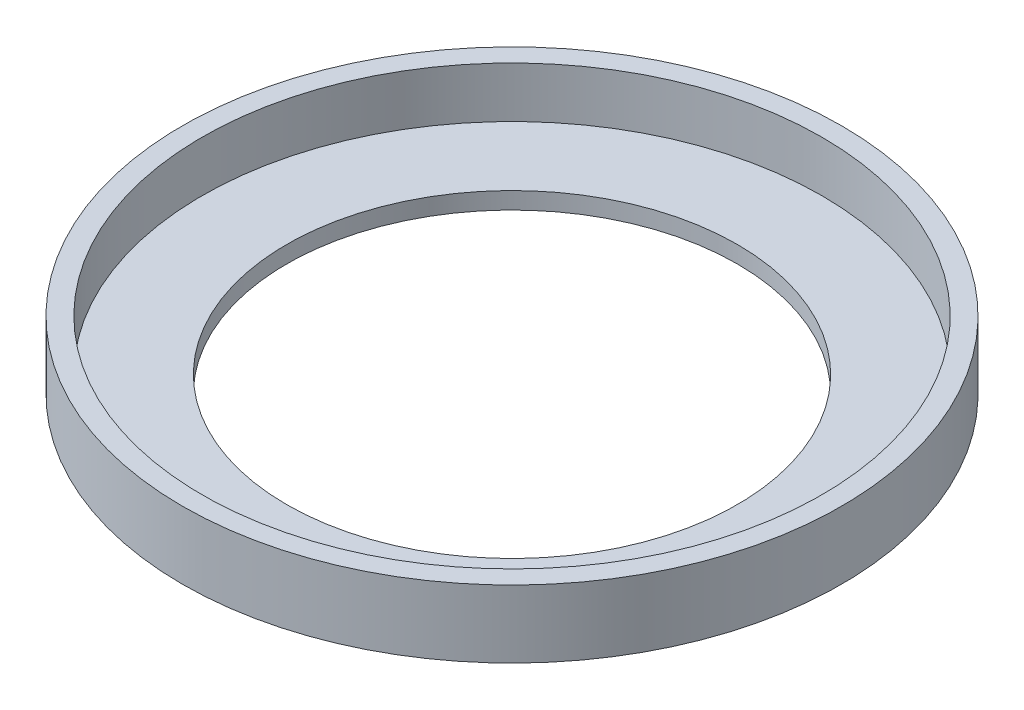
ISO-10303-21;
HEADER;
FILE_DESCRIPTION(('STEP AP214'),'2;1');
FILE_NAME('part.step','',(''),(''),'','','');
FILE_SCHEMA(('AUTOMOTIVE_DESIGN { 1 0 10303 214 1 1 1 1 }'));
ENDSEC;
DATA;
#1=APPLICATION_CONTEXT('core data for automotive mechanical design processes');
#2=APPLICATION_PROTOCOL_DEFINITION('international standard','automotive_design',2000,#1);
#3=PRODUCT_CONTEXT('',#1,'mechanical');
#4=PRODUCT('Part','Part','',(#3));
#5=PRODUCT_RELATED_PRODUCT_CATEGORY('part','',(#4));
#6=PRODUCT_DEFINITION_FORMATION('','',#4);
#7=PRODUCT_DEFINITION_CONTEXT('part definition',#1,'design');
#8=PRODUCT_DEFINITION('design','',#6,#7);
#9=PRODUCT_DEFINITION_SHAPE('','',#8);
#10=(LENGTH_UNIT() NAMED_UNIT(*) SI_UNIT(.MILLI.,.METRE.));
#11=(NAMED_UNIT(*) PLANE_ANGLE_UNIT() SI_UNIT($,.RADIAN.));
#12=(NAMED_UNIT(*) SI_UNIT($,.STERADIAN.) SOLID_ANGLE_UNIT());
#13=UNCERTAINTY_MEASURE_WITH_UNIT(LENGTH_MEASURE(1.E-05),#10,'distance_accuracy_value','');
#14=(GEOMETRIC_REPRESENTATION_CONTEXT(3) GLOBAL_UNCERTAINTY_ASSIGNED_CONTEXT((#13)) GLOBAL_UNIT_ASSIGNED_CONTEXT((#10,
#11,#12)) REPRESENTATION_CONTEXT('',''));
#15=CARTESIAN_POINT('',(0.,0.,0.));
#16=DIRECTION('',(0.,0.,1.));
#17=DIRECTION('',(1.,0.,0.));
#18=AXIS2_PLACEMENT_3D('',#15,#16,#17);
#19=CARTESIAN_POINT('',(0.,0.,0.));
#20=DIRECTION('',(0.,-1.,0.));
#21=DIRECTION('',(0.,0.,-1.));
#22=AXIS2_PLACEMENT_3D('',#19,#20,#21);
#23=CYLINDRICAL_SURFACE('',#22,4.);
#24=CARTESIAN_POINT('',(0.,0.,0.));
#25=DIRECTION('',(0.,-1.,0.));
#26=DIRECTION('',(0.,0.,-1.));
#27=AXIS2_PLACEMENT_3D('',#24,#25,#26);
#28=CIRCLE('',#27,4.);
#29=CARTESIAN_POINT('',(0.,0.,-4.));
#30=VERTEX_POINT('',#29);
#31=EDGE_CURVE('E10',#30,#30,#28,.T.);
#32=ORIENTED_EDGE('',*,*,#31,.T.);
#33=EDGE_LOOP('',(#32));
#34=FACE_BOUND('',#33,.T.);
#35=CARTESIAN_POINT('',(0.,0.3,0.));
#36=DIRECTION('',(0.,-1.,0.));
#37=DIRECTION('',(0.,0.,-1.));
#38=AXIS2_PLACEMENT_3D('',#35,#36,#37);
#39=CIRCLE('',#38,4.);
#40=CARTESIAN_POINT('',(0.,0.3,-4.));
#41=VERTEX_POINT('',#40);
#42=EDGE_CURVE('E50',#41,#41,#39,.T.);
#43=ORIENTED_EDGE('',*,*,#42,.F.);
#44=EDGE_LOOP('',(#43));
#45=FACE_BOUND('',#44,.T.);
#46=ADVANCED_FACE('F28',(#34,#45),#23,.F.);
#47=CARTESIAN_POINT('',(4.,0.,0.));
#48=DIRECTION('',(0.,-1.,0.));
#49=DIRECTION('',(0.,0.,-1.));
#50=AXIS2_PLACEMENT_3D('',#47,#48,#49);
#51=PLANE('',#50);
#52=CARTESIAN_POINT('',(0.,0.,0.));
#53=DIRECTION('',(0.,-1.,0.));
#54=DIRECTION('',(0.,0.,-1.));
#55=AXIS2_PLACEMENT_3D('',#52,#53,#54);
#56=CIRCLE('',#55,5.85);
#57=CARTESIAN_POINT('',(0.,0.,-5.85));
#58=VERTEX_POINT('',#57);
#59=EDGE_CURVE('E34',#58,#58,#56,.T.);
#60=ORIENTED_EDGE('',*,*,#59,.T.);
#61=EDGE_LOOP('',(#60));
#62=FACE_BOUND('',#61,.T.);
#63=ORIENTED_EDGE('',*,*,#31,.F.);
#64=EDGE_LOOP('',(#63));
#65=FACE_BOUND('',#64,.T.);
#66=ADVANCED_FACE('F58',(#62,#65),#51,.T.);
#67=CARTESIAN_POINT('',(0.,0.,0.));
#68=DIRECTION('',(0.,-1.,0.));
#69=DIRECTION('',(0.,0.,-1.));
#70=AXIS2_PLACEMENT_3D('',#67,#68,#69);
#71=CYLINDRICAL_SURFACE('',#70,5.85);
#72=CARTESIAN_POINT('',(0.,1.2,0.));
#73=DIRECTION('',(0.,-1.,0.));
#74=DIRECTION('',(0.,0.,-1.));
#75=AXIS2_PLACEMENT_3D('',#72,#73,#74);
#76=CIRCLE('',#75,5.85);
#77=CARTESIAN_POINT('',(0.,1.2,-5.85));
#78=VERTEX_POINT('',#77);
#79=EDGE_CURVE('E38',#78,#78,#76,.T.);
#80=ORIENTED_EDGE('',*,*,#79,.T.);
#81=EDGE_LOOP('',(#80));
#82=FACE_BOUND('',#81,.T.);
#83=ORIENTED_EDGE('',*,*,#59,.F.);
#84=EDGE_LOOP('',(#83));
#85=FACE_BOUND('',#84,.T.);
#86=ADVANCED_FACE('F62',(#82,#85),#71,.T.);
#87=CARTESIAN_POINT('',(5.85,1.2,0.));
#88=DIRECTION('',(0.,1.,0.));
#89=DIRECTION('',(0.,0.,1.));
#90=AXIS2_PLACEMENT_3D('',#87,#88,#89);
#91=PLANE('',#90);
#92=CARTESIAN_POINT('',(0.,1.2,0.));
#93=DIRECTION('',(0.,-1.,0.));
#94=DIRECTION('',(0.,0.,-1.));
#95=AXIS2_PLACEMENT_3D('',#92,#93,#94);
#96=CIRCLE('',#95,5.5);
#97=CARTESIAN_POINT('',(0.,1.2,-5.5));
#98=VERTEX_POINT('',#97);
#99=EDGE_CURVE('E42',#98,#98,#96,.T.);
#100=ORIENTED_EDGE('',*,*,#99,.T.);
#101=EDGE_LOOP('',(#100));
#102=FACE_BOUND('',#101,.T.);
#103=ORIENTED_EDGE('',*,*,#79,.F.);
#104=EDGE_LOOP('',(#103));
#105=FACE_BOUND('',#104,.T.);
#106=ADVANCED_FACE('F66',(#102,#105),#91,.T.);
#107=CARTESIAN_POINT('',(0.,0.,0.));
#108=DIRECTION('',(0.,-1.,0.));
#109=DIRECTION('',(0.,0.,-1.));
#110=AXIS2_PLACEMENT_3D('',#107,#108,#109);
#111=CYLINDRICAL_SURFACE('',#110,5.5);
#112=CARTESIAN_POINT('',(0.,0.3,0.));
#113=DIRECTION('',(0.,-1.,0.));
#114=DIRECTION('',(0.,0.,-1.));
#115=AXIS2_PLACEMENT_3D('',#112,#113,#114);
#116=CIRCLE('',#115,5.5);
#117=CARTESIAN_POINT('',(0.,0.3,-5.5));
#118=VERTEX_POINT('',#117);
#119=EDGE_CURVE('E47',#118,#118,#116,.T.);
#120=ORIENTED_EDGE('',*,*,#119,.T.);
#121=EDGE_LOOP('',(#120));
#122=FACE_BOUND('',#121,.T.);
#123=ORIENTED_EDGE('',*,*,#99,.F.);
#124=EDGE_LOOP('',(#123));
#125=FACE_BOUND('',#124,.T.);
#126=ADVANCED_FACE('F73',(#122,#125),#111,.F.);
#127=CARTESIAN_POINT('',(5.5,0.3,0.));
#128=DIRECTION('',(0.,1.,0.));
#129=DIRECTION('',(0.,0.,1.));
#130=AXIS2_PLACEMENT_3D('',#127,#128,#129);
#131=PLANE('',#130);
#132=ORIENTED_EDGE('',*,*,#42,.T.);
#133=EDGE_LOOP('',(#132));
#134=FACE_BOUND('',#133,.T.);
#135=ORIENTED_EDGE('',*,*,#119,.F.);
#136=EDGE_LOOP('',(#135));
#137=FACE_BOUND('',#136,.T.);
#138=ADVANCED_FACE('F54',(#134,#137),#131,.T.);
#139=CLOSED_SHELL('',(#46,#66,#86,#106,#126,#138));
#140=MANIFOLD_SOLID_BREP('B2',#139);
#141=ADVANCED_BREP_SHAPE_REPRESENTATION('',(#18,#140),#14);
#142=SHAPE_DEFINITION_REPRESENTATION(#9,#141);
ENDSEC;
END-ISO-10303-21;
